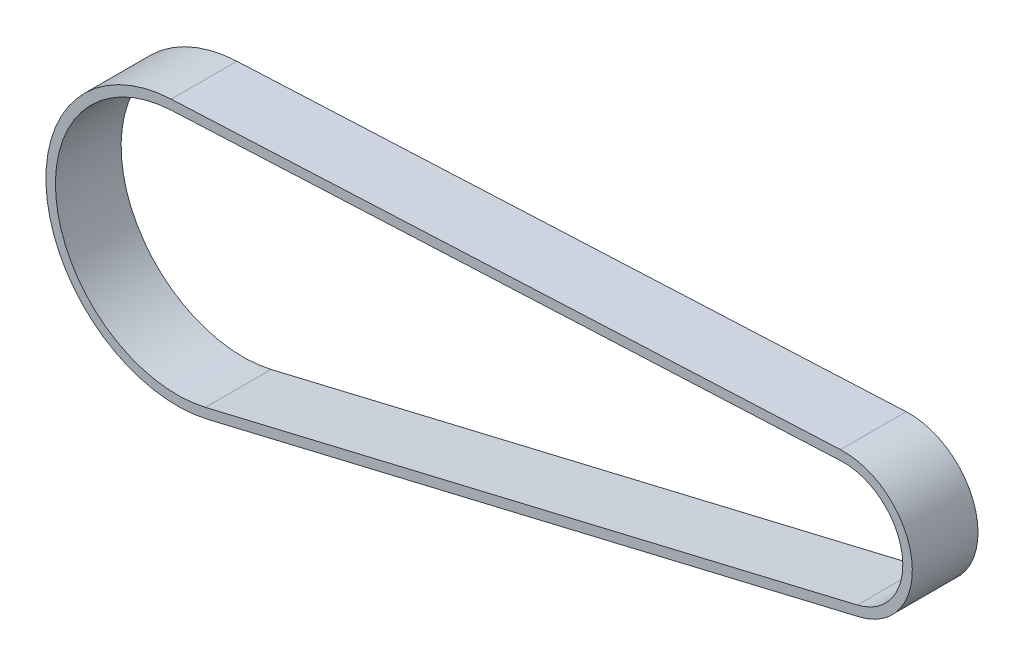
ISO-10303-21;
HEADER;
FILE_DESCRIPTION(('STEP AP214'),'2;1');
FILE_NAME('part.step','',(''),(''),'','','');
FILE_SCHEMA(('AUTOMOTIVE_DESIGN { 1 0 10303 214 1 1 1 1 }'));
ENDSEC;
DATA;
#1=APPLICATION_CONTEXT('core data for automotive mechanical design processes');
#2=APPLICATION_PROTOCOL_DEFINITION('international standard','automotive_design',2000,#1);
#3=PRODUCT_CONTEXT('',#1,'mechanical');
#4=PRODUCT('Part','Part','',(#3));
#5=PRODUCT_RELATED_PRODUCT_CATEGORY('part','',(#4));
#6=PRODUCT_DEFINITION_FORMATION('','',#4);
#7=PRODUCT_DEFINITION_CONTEXT('part definition',#1,'design');
#8=PRODUCT_DEFINITION('design','',#6,#7);
#9=PRODUCT_DEFINITION_SHAPE('','',#8);
#10=(LENGTH_UNIT() NAMED_UNIT(*) SI_UNIT(.MILLI.,.METRE.));
#11=(NAMED_UNIT(*) PLANE_ANGLE_UNIT() SI_UNIT($,.RADIAN.));
#12=(NAMED_UNIT(*) SI_UNIT($,.STERADIAN.) SOLID_ANGLE_UNIT());
#13=UNCERTAINTY_MEASURE_WITH_UNIT(LENGTH_MEASURE(1.E-05),#10,'distance_accuracy_value','');
#14=(GEOMETRIC_REPRESENTATION_CONTEXT(3) GLOBAL_UNCERTAINTY_ASSIGNED_CONTEXT((#13)) GLOBAL_UNIT_ASSIGNED_CONTEXT((#10,
#11,#12)) REPRESENTATION_CONTEXT('',''));
#15=CARTESIAN_POINT('',(0.,0.,0.));
#16=DIRECTION('',(0.,0.,1.));
#17=DIRECTION('',(1.,0.,0.));
#18=AXIS2_PLACEMENT_3D('',#15,#16,#17);
#19=CARTESIAN_POINT('',(-30.6518300753381,-1.39818712163731E-12,0.));
#20=DIRECTION('',(0.,0.,1.));
#21=DIRECTION('',(1.,0.,0.));
#22=AXIS2_PLACEMENT_3D('',#19,#20,#21);
#23=PLANE('',#22);
#24=CARTESIAN_POINT('',(-30.6518300753381,-1.39818712163731E-12,0.));
#25=DIRECTION('',(0.,0.,1.));
#26=DIRECTION('',(-1.,0.,0.));
#27=AXIS2_PLACEMENT_3D('',#24,#25,#26);
#28=CIRCLE('',#27,7.21318939554294);
#29=CARTESIAN_POINT('',(-28.9855429363466,-7.01809008394908,0.));
#30=VERTEX_POINT('',#29);
#31=CARTESIAN_POINT('',(-30.9869909813873,7.2053985610103,0.));
#32=VERTEX_POINT('',#31);
#33=EDGE_CURVE('E175',#30,#32,#28,.T.);
#34=ORIENTED_EDGE('',*,*,#33,.F.);
#35=DIRECTION('',(0.972952420781324,0.231005599273612,0.));
#36=VECTOR('',#35,1.);
#37=CARTESIAN_POINT('',(-28.9855429363466,-7.01809008394908,0.));
#38=LINE('',#37,#36);
#39=CARTESIAN_POINT('',(-97.4639528053642,-23.2767434067839,0.));
#40=VERTEX_POINT('',#39);
#41=EDGE_CURVE('E138',#40,#30,#38,.T.);
#42=ORIENTED_EDGE('',*,*,#41,.F.);
#43=CARTESIAN_POINT('',(-100.65183007534,-9.85000000000158,0.));
#44=DIRECTION('',(0.,0.,1.));
#45=DIRECTION('',(-1.,0.,0.));
#46=AXIS2_PLACEMENT_3D('',#43,#44,#45);
#47=CIRCLE('',#46,13.8);
#48=CARTESIAN_POINT('',(-101.293047191632,3.93509487126332,0.));
#49=VERTEX_POINT('',#48);
#50=EDGE_CURVE('E167',#49,#40,#47,.T.);
#51=ORIENTED_EDGE('',*,*,#50,.F.);
#52=DIRECTION('',(-0.998919918207602,-0.0464650084269702,0.));
#53=VECTOR('',#52,1.);
#54=CARTESIAN_POINT('',(-101.293047191632,3.93509487126332,0.));
#55=LINE('',#54,#53);
#56=EDGE_CURVE('E162',#32,#49,#55,.T.);
#57=ORIENTED_EDGE('',*,*,#56,.F.);
#58=EDGE_LOOP('',(#34,#42,#51,#57));
#59=FACE_BOUND('',#58,.T.);
#60=CARTESIAN_POINT('',(-30.6518300753381,-1.39818712163731E-12,0.));
#61=DIRECTION('',(0.,0.,-1.));
#62=DIRECTION('',(-1.,0.,0.));
#63=AXIS2_PLACEMENT_3D('',#60,#61,#62);
#64=CIRCLE('',#63,6.21318939554294);
#65=CARTESIAN_POINT('',(-29.2165485356202,-6.04513766316776,0.));
#66=VERTEX_POINT('',#65);
#67=CARTESIAN_POINT('',(-30.9405259729603,6.20647864280269,0.));
#68=VERTEX_POINT('',#67);
#69=EDGE_CURVE('E133',#66,#68,#64,.F.);
#70=ORIENTED_EDGE('',*,*,#69,.T.);
#71=DIRECTION('',(-0.998919918207602,-0.0464650084269702,0.));
#72=VECTOR('',#71,1.);
#73=CARTESIAN_POINT('',(-30.9405259729604,6.20647864280269,0.));
#74=LINE('',#73,#72);
#75=CARTESIAN_POINT('',(-101.246582183205,2.93617495305572,0.));
#76=VERTEX_POINT('',#75);
#77=EDGE_CURVE('E141',#68,#76,#74,.T.);
#78=ORIENTED_EDGE('',*,*,#77,.T.);
#79=CARTESIAN_POINT('',(-100.65183007534,-9.85000000000158,0.));
#80=DIRECTION('',(0.,0.,-1.));
#81=DIRECTION('',(-1.,0.,0.));
#82=AXIS2_PLACEMENT_3D('',#79,#80,#81);
#83=CIRCLE('',#82,12.8);
#84=CARTESIAN_POINT('',(-97.6949584046378,-22.3037909860025,0.));
#85=VERTEX_POINT('',#84);
#86=EDGE_CURVE('E146',#76,#85,#83,.F.);
#87=ORIENTED_EDGE('',*,*,#86,.T.);
#88=DIRECTION('',(0.972952420781324,0.231005599273612,0.));
#89=VECTOR('',#88,1.);
#90=CARTESIAN_POINT('',(-29.2165485356202,-6.04513766316776,0.));
#91=LINE('',#90,#89);
#92=EDGE_CURVE('E149',#85,#66,#91,.T.);
#93=ORIENTED_EDGE('',*,*,#92,.T.);
#94=EDGE_LOOP('',(#70,#78,#87,#93));
#95=FACE_BOUND('',#94,.T.);
#96=ADVANCED_FACE('F67',(#59,#95),#23,.F.);
#97=CARTESIAN_POINT('',(-30.6518300753381,-1.39818712163731E-12,103.003782982849));
#98=DIRECTION('',(0.,0.,-1.));
#99=DIRECTION('',(-1.,0.,0.));
#100=AXIS2_PLACEMENT_3D('',#97,#98,#99);
#101=CYLINDRICAL_SURFACE('',#100,7.21318939554294);
#102=DIRECTION('',(0.,0.,-1.));
#103=VECTOR('',#102,1.);
#104=CARTESIAN_POINT('',(-30.9869909813873,7.2053985610103,103.003782982849));
#105=LINE('',#104,#103);
#106=CARTESIAN_POINT('',(-30.9869909813873,7.2053985610103,6.89999999999965));
#107=VERTEX_POINT('',#106);
#108=EDGE_CURVE('E159',#107,#32,#105,.T.);
#109=ORIENTED_EDGE('',*,*,#108,.F.);
#110=CARTESIAN_POINT('',(-30.6518300753381,-1.39818712163731E-12,6.89999999999964));
#111=DIRECTION('',(0.,0.,-1.));
#112=DIRECTION('',(-1.,0.,0.));
#113=AXIS2_PLACEMENT_3D('',#110,#111,#112);
#114=CIRCLE('',#113,7.21318939554294);
#115=CARTESIAN_POINT('',(-28.9855429363466,-7.01809008394908,6.8999999999996));
#116=VERTEX_POINT('',#115);
#117=EDGE_CURVE('E85',#107,#116,#114,.T.);
#118=ORIENTED_EDGE('',*,*,#117,.T.);
#119=DIRECTION('',(0.,0.,-1.));
#120=VECTOR('',#119,1.);
#121=CARTESIAN_POINT('',(-28.9855429363466,-7.01809008394908,103.003782982849));
#122=LINE('',#121,#120);
#123=EDGE_CURVE('E173',#116,#30,#122,.T.);
#124=ORIENTED_EDGE('',*,*,#123,.T.);
#125=ORIENTED_EDGE('',*,*,#33,.T.);
#126=EDGE_LOOP('',(#109,#118,#124,#125));
#127=FACE_BOUND('',#126,.T.);
#128=ADVANCED_FACE('F230',(#127),#101,.T.);
#129=CARTESIAN_POINT('',(-101.293047191632,3.93509487126332,103.003782982849));
#130=DIRECTION('',(0.0464650084269702,-0.998919918207602,0.));
#131=DIRECTION('',(0.998919918207602,0.0464650084269702,0.));
#132=AXIS2_PLACEMENT_3D('',#129,#130,#131);
#133=PLANE('',#132);
#134=DIRECTION('',(0.,0.,-1.));
#135=VECTOR('',#134,1.);
#136=CARTESIAN_POINT('',(-101.293047191632,3.93509487126332,103.003782982849));
#137=LINE('',#136,#135);
#138=CARTESIAN_POINT('',(-101.293047191632,3.93509487126332,6.90000000000155));
#139=VERTEX_POINT('',#138);
#140=EDGE_CURVE('E164',#139,#49,#137,.T.);
#141=ORIENTED_EDGE('',*,*,#140,.F.);
#142=DIRECTION('',(0.998919918207602,0.0464650084269702,0.));
#143=VECTOR('',#142,1.);
#144=CARTESIAN_POINT('',(-101.293047191635,3.9350948712632,6.90000000000156));
#145=LINE('',#144,#143);
#146=EDGE_CURVE('E163',#139,#107,#145,.T.);
#147=ORIENTED_EDGE('',*,*,#146,.T.);
#148=ORIENTED_EDGE('',*,*,#108,.T.);
#149=ORIENTED_EDGE('',*,*,#56,.T.);
#150=EDGE_LOOP('',(#141,#147,#148,#149));
#151=FACE_BOUND('',#150,.T.);
#152=ADVANCED_FACE('F218',(#151),#133,.F.);
#153=CARTESIAN_POINT('',(-100.65183007534,-9.85000000000158,103.003782982849));
#154=DIRECTION('',(0.,0.,-1.));
#155=DIRECTION('',(-1.,0.,0.));
#156=AXIS2_PLACEMENT_3D('',#153,#154,#155);
#157=CYLINDRICAL_SURFACE('',#156,13.8);
#158=DIRECTION('',(0.,0.,-1.));
#159=VECTOR('',#158,1.);
#160=CARTESIAN_POINT('',(-97.4639528053642,-23.2767434067839,103.003782982849));
#161=LINE('',#160,#159);
#162=CARTESIAN_POINT('',(-97.4639528053642,-23.2767434067839,6.90000000000056));
#163=VERTEX_POINT('',#162);
#164=EDGE_CURVE('E169',#163,#40,#161,.T.);
#165=ORIENTED_EDGE('',*,*,#164,.F.);
#166=CARTESIAN_POINT('',(-100.65183007534,-9.85000000000158,6.90000000000154));
#167=DIRECTION('',(0.,0.,-1.));
#168=DIRECTION('',(-1.,0.,0.));
#169=AXIS2_PLACEMENT_3D('',#166,#167,#168);
#170=CIRCLE('',#169,13.8);
#171=EDGE_CURVE('E168',#163,#139,#170,.T.);
#172=ORIENTED_EDGE('',*,*,#171,.T.);
#173=ORIENTED_EDGE('',*,*,#140,.T.);
#174=ORIENTED_EDGE('',*,*,#50,.T.);
#175=EDGE_LOOP('',(#165,#172,#173,#174));
#176=FACE_BOUND('',#175,.T.);
#177=ADVANCED_FACE('F223',(#176),#157,.T.);
#178=CARTESIAN_POINT('',(-28.9855429363466,-7.01809008394908,103.003782982849));
#179=DIRECTION('',(-0.231005599273612,0.972952420781324,0.));
#180=DIRECTION('',(-0.972952420781325,-0.231005599273612,0.));
#181=AXIS2_PLACEMENT_3D('',#178,#179,#180);
#182=PLANE('',#181);
#183=ORIENTED_EDGE('',*,*,#123,.F.);
#184=DIRECTION('',(-0.972952420781325,-0.231005599273612,0.));
#185=VECTOR('',#184,1.);
#186=CARTESIAN_POINT('',(-28.9855429363491,-7.01809008394967,6.8999999999996));
#187=LINE('',#186,#185);
#188=EDGE_CURVE('E172',#116,#163,#187,.T.);
#189=ORIENTED_EDGE('',*,*,#188,.T.);
#190=ORIENTED_EDGE('',*,*,#164,.T.);
#191=ORIENTED_EDGE('',*,*,#41,.T.);
#192=EDGE_LOOP('',(#183,#189,#190,#191));
#193=FACE_BOUND('',#192,.T.);
#194=ADVANCED_FACE('F228',(#193),#182,.F.);
#195=CARTESIAN_POINT('',(-30.6518300753381,-1.39818712163731E-12,103.003782982849));
#196=DIRECTION('',(0.,0.,-1.));
#197=DIRECTION('',(-1.,0.,0.));
#198=AXIS2_PLACEMENT_3D('',#195,#196,#197);
#199=CYLINDRICAL_SURFACE('',#198,6.21318939554294);
#200=CARTESIAN_POINT('',(-30.6518300753381,-1.39818712163731E-12,6.89999999999964));
#201=DIRECTION('',(0.,0.,-1.));
#202=DIRECTION('',(-1.,0.,0.));
#203=AXIS2_PLACEMENT_3D('',#200,#201,#202);
#204=CIRCLE('',#203,6.21318939554294);
#205=CARTESIAN_POINT('',(-30.9405259729603,6.20647864280269,6.89999999999964));
#206=VERTEX_POINT('',#205);
#207=CARTESIAN_POINT('',(-29.2165485356202,-6.04513766316776,6.90000000000056));
#208=VERTEX_POINT('',#207);
#209=EDGE_CURVE('E136',#206,#208,#204,.T.);
#210=ORIENTED_EDGE('',*,*,#209,.F.);
#211=DIRECTION('',(0.,0.,-1.));
#212=VECTOR('',#211,1.);
#213=CARTESIAN_POINT('',(-30.9405259729603,6.20647864280269,103.003782982849));
#214=LINE('',#213,#212);
#215=EDGE_CURVE('E129',#206,#68,#214,.T.);
#216=ORIENTED_EDGE('',*,*,#215,.T.);
#217=ORIENTED_EDGE('',*,*,#69,.F.);
#218=DIRECTION('',(0.,0.,-1.));
#219=VECTOR('',#218,1.);
#220=CARTESIAN_POINT('',(-29.2165485356202,-6.04513766316776,103.003782982849));
#221=LINE('',#220,#219);
#222=EDGE_CURVE('E182',#208,#66,#221,.T.);
#223=ORIENTED_EDGE('',*,*,#222,.F.);
#224=EDGE_LOOP('',(#210,#216,#217,#223));
#225=FACE_BOUND('',#224,.T.);
#226=ADVANCED_FACE('F130',(#225),#199,.F.);
#227=CARTESIAN_POINT('',(-30.9405259729604,6.20647864280269,103.003782982849));
#228=DIRECTION('',(0.0464650084269702,-0.998919918207602,0.));
#229=DIRECTION('',(0.998919918207602,0.0464650084269702,0.));
#230=AXIS2_PLACEMENT_3D('',#227,#228,#229);
#231=PLANE('',#230);
#232=DIRECTION('',(0.998919918207602,0.0464650084269702,0.));
#233=VECTOR('',#232,1.);
#234=CARTESIAN_POINT('',(-30.940525972963,6.20647864280257,6.89999999999964));
#235=LINE('',#234,#233);
#236=CARTESIAN_POINT('',(-101.246582183205,2.93617495305572,6.90000000000155));
#237=VERTEX_POINT('',#236);
#238=EDGE_CURVE('E12',#237,#206,#235,.T.);
#239=ORIENTED_EDGE('',*,*,#238,.F.);
#240=DIRECTION('',(0.,0.,-1.));
#241=VECTOR('',#240,1.);
#242=CARTESIAN_POINT('',(-101.246582183205,2.93617495305572,103.003782982849));
#243=LINE('',#242,#241);
#244=EDGE_CURVE('E122',#237,#76,#243,.T.);
#245=ORIENTED_EDGE('',*,*,#244,.T.);
#246=ORIENTED_EDGE('',*,*,#77,.F.);
#247=ORIENTED_EDGE('',*,*,#215,.F.);
#248=EDGE_LOOP('',(#239,#245,#246,#247));
#249=FACE_BOUND('',#248,.T.);
#250=ADVANCED_FACE('F142',(#249),#231,.T.);
#251=CARTESIAN_POINT('',(-100.65183007534,-9.85000000000158,103.003782982849));
#252=DIRECTION('',(0.,0.,-1.));
#253=DIRECTION('',(-1.,0.,0.));
#254=AXIS2_PLACEMENT_3D('',#251,#252,#253);
#255=CYLINDRICAL_SURFACE('',#254,12.8);
#256=CARTESIAN_POINT('',(-100.65183007534,-9.85000000000158,6.90000000000154));
#257=DIRECTION('',(0.,0.,-1.));
#258=DIRECTION('',(-1.,0.,0.));
#259=AXIS2_PLACEMENT_3D('',#256,#257,#258);
#260=CIRCLE('',#259,12.8);
#261=CARTESIAN_POINT('',(-97.6949584046378,-22.3037909860025,6.90000000000146));
#262=VERTEX_POINT('',#261);
#263=EDGE_CURVE('E71',#262,#237,#260,.T.);
#264=ORIENTED_EDGE('',*,*,#263,.F.);
#265=DIRECTION('',(0.,0.,-1.));
#266=VECTOR('',#265,1.);
#267=CARTESIAN_POINT('',(-97.6949584046378,-22.3037909860025,103.003782982849));
#268=LINE('',#267,#266);
#269=EDGE_CURVE('E179',#262,#85,#268,.T.);
#270=ORIENTED_EDGE('',*,*,#269,.T.);
#271=ORIENTED_EDGE('',*,*,#86,.F.);
#272=ORIENTED_EDGE('',*,*,#244,.F.);
#273=EDGE_LOOP('',(#264,#270,#271,#272));
#274=FACE_BOUND('',#273,.T.);
#275=ADVANCED_FACE('F207',(#274),#255,.F.);
#276=CARTESIAN_POINT('',(-29.2165485356202,-6.04513766316776,103.003782982849));
#277=DIRECTION('',(-0.231005599273612,0.972952420781324,0.));
#278=DIRECTION('',(-0.972952420781325,-0.231005599273612,0.));
#279=AXIS2_PLACEMENT_3D('',#276,#277,#278);
#280=PLANE('',#279);
#281=DIRECTION('',(-0.972952420781325,-0.231005599273612,0.));
#282=VECTOR('',#281,1.);
#283=CARTESIAN_POINT('',(-29.2165485356227,-6.04513766316834,6.8999999999996));
#284=LINE('',#283,#282);
#285=EDGE_CURVE('E155',#208,#262,#284,.T.);
#286=ORIENTED_EDGE('',*,*,#285,.F.);
#287=ORIENTED_EDGE('',*,*,#222,.T.);
#288=ORIENTED_EDGE('',*,*,#92,.F.);
#289=ORIENTED_EDGE('',*,*,#269,.F.);
#290=EDGE_LOOP('',(#286,#287,#288,#289));
#291=FACE_BOUND('',#290,.T.);
#292=ADVANCED_FACE('F204',(#291),#280,.T.);
#293=CARTESIAN_POINT('',(-100.65183007534,-9.85000000000153,6.90000000000154));
#294=DIRECTION('',(0.,0.,-1.));
#295=DIRECTION('',(0.716597453867016,0.697486981320303,0.));
#296=AXIS2_PLACEMENT_3D('',#293,#294,#295);
#297=PLANE('',#296);
#298=ORIENTED_EDGE('',*,*,#209,.T.);
#299=ORIENTED_EDGE('',*,*,#285,.T.);
#300=ORIENTED_EDGE('',*,*,#263,.T.);
#301=ORIENTED_EDGE('',*,*,#238,.T.);
#302=EDGE_LOOP('',(#298,#299,#300,#301));
#303=FACE_BOUND('',#302,.T.);
#304=ORIENTED_EDGE('',*,*,#146,.F.);
#305=ORIENTED_EDGE('',*,*,#171,.F.);
#306=ORIENTED_EDGE('',*,*,#188,.F.);
#307=ORIENTED_EDGE('',*,*,#117,.F.);
#308=EDGE_LOOP('',(#304,#305,#306,#307));
#309=FACE_BOUND('',#308,.T.);
#310=ADVANCED_FACE('F69',(#303,#309),#297,.F.);
#311=CLOSED_SHELL('',(#96,#128,#152,#177,#194,#226,#250,#275,#292,#310));
#312=MANIFOLD_SOLID_BREP('B2',#311);
#313=ADVANCED_BREP_SHAPE_REPRESENTATION('',(#18,#312),#14);
#314=SHAPE_DEFINITION_REPRESENTATION(#9,#313);
ENDSEC;
END-ISO-10303-21;
